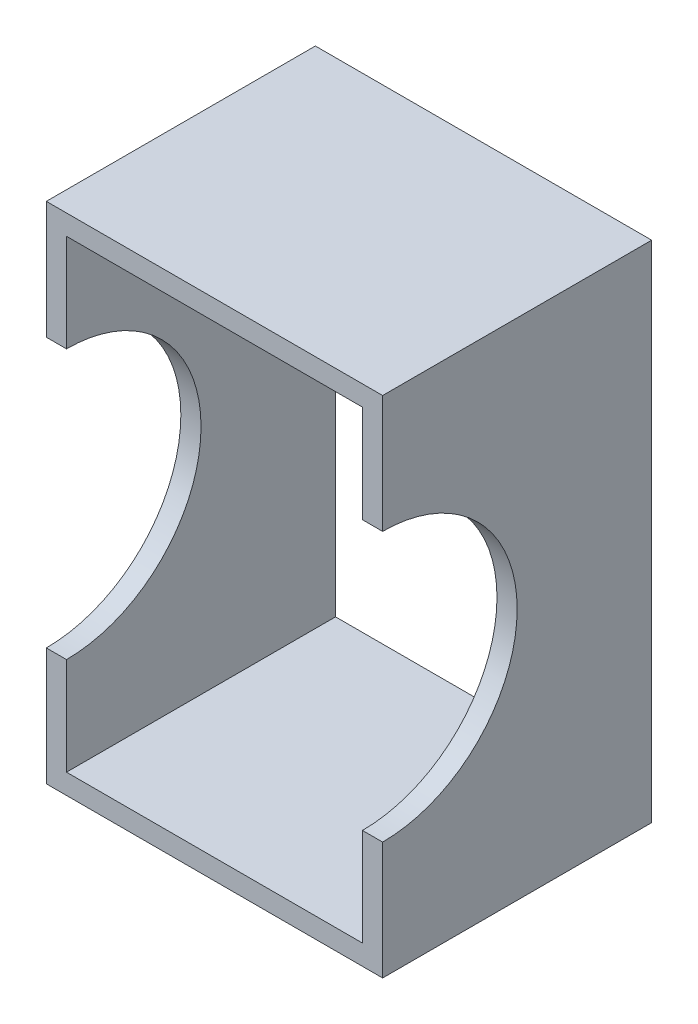
ISO-10303-21;
HEADER;
FILE_DESCRIPTION(('STEP AP214'),'2;1');
FILE_NAME('part.step','',(''),(''),'','','');
FILE_SCHEMA(('AUTOMOTIVE_DESIGN { 1 0 10303 214 1 1 1 1 }'));
ENDSEC;
DATA;
#1=APPLICATION_CONTEXT('core data for automotive mechanical design processes');
#2=APPLICATION_PROTOCOL_DEFINITION('international standard','automotive_design',2000,#1);
#3=PRODUCT_CONTEXT('',#1,'mechanical');
#4=PRODUCT('Part','Part','',(#3));
#5=PRODUCT_RELATED_PRODUCT_CATEGORY('part','',(#4));
#6=PRODUCT_DEFINITION_FORMATION('','',#4);
#7=PRODUCT_DEFINITION_CONTEXT('part definition',#1,'design');
#8=PRODUCT_DEFINITION('design','',#6,#7);
#9=PRODUCT_DEFINITION_SHAPE('','',#8);
#10=(LENGTH_UNIT() NAMED_UNIT(*) SI_UNIT(.MILLI.,.METRE.));
#11=(NAMED_UNIT(*) PLANE_ANGLE_UNIT() SI_UNIT($,.RADIAN.));
#12=(NAMED_UNIT(*) SI_UNIT($,.STERADIAN.) SOLID_ANGLE_UNIT());
#13=UNCERTAINTY_MEASURE_WITH_UNIT(LENGTH_MEASURE(1.E-05),#10,'distance_accuracy_value','');
#14=(GEOMETRIC_REPRESENTATION_CONTEXT(3) GLOBAL_UNCERTAINTY_ASSIGNED_CONTEXT((#13)) GLOBAL_UNIT_ASSIGNED_CONTEXT((#10,
#11,#12)) REPRESENTATION_CONTEXT('',''));
#15=CARTESIAN_POINT('',(0.,0.,0.));
#16=DIRECTION('',(0.,0.,1.));
#17=DIRECTION('',(1.,0.,0.));
#18=AXIS2_PLACEMENT_3D('',#15,#16,#17);
#19=CARTESIAN_POINT('',(0.,0.,0.));
#20=DIRECTION('',(0.,0.,-1.));
#21=DIRECTION('',(-1.,0.,0.));
#22=AXIS2_PLACEMENT_3D('',#19,#20,#21);
#23=PLANE('',#22);
#24=DIRECTION('',(0.,-1.,0.));
#25=VECTOR('',#24,1.);
#26=CARTESIAN_POINT('',(-50.,-75.,0.));
#27=LINE('',#26,#25);
#28=CARTESIAN_POINT('',(-50.,74.9999999999999,0.));
#29=VERTEX_POINT('',#28);
#30=CARTESIAN_POINT('',(-50.,40.,0.));
#31=VERTEX_POINT('',#30);
#32=EDGE_CURVE('E136',#29,#31,#27,.T.);
#33=ORIENTED_EDGE('',*,*,#32,.T.);
#34=DIRECTION('',(1.,0.,0.));
#35=VECTOR('',#34,1.);
#36=CARTESIAN_POINT('',(-50.,40.,0.));
#37=LINE('',#36,#35);
#38=CARTESIAN_POINT('',(-44.,40.,0.));
#39=VERTEX_POINT('',#38);
#40=EDGE_CURVE('E123',#31,#39,#37,.T.);
#41=ORIENTED_EDGE('',*,*,#40,.T.);
#42=DIRECTION('',(0.,-1.,0.));
#43=VECTOR('',#42,1.);
#44=CARTESIAN_POINT('',(-44.,-69.,0.));
#45=LINE('',#44,#43);
#46=CARTESIAN_POINT('',(-44.,69.,0.));
#47=VERTEX_POINT('',#46);
#48=EDGE_CURVE('E204',#47,#39,#45,.T.);
#49=ORIENTED_EDGE('',*,*,#48,.F.);
#50=DIRECTION('',(-1.,0.,0.));
#51=VECTOR('',#50,1.);
#52=CARTESIAN_POINT('',(-44.,69.,0.));
#53=LINE('',#52,#51);
#54=CARTESIAN_POINT('',(44.,69.,0.));
#55=VERTEX_POINT('',#54);
#56=EDGE_CURVE('E194',#55,#47,#53,.T.);
#57=ORIENTED_EDGE('',*,*,#56,.F.);
#58=DIRECTION('',(0.,1.,0.));
#59=VECTOR('',#58,1.);
#60=CARTESIAN_POINT('',(44.,-69.,0.));
#61=LINE('',#60,#59);
#62=CARTESIAN_POINT('',(44.,40.,0.));
#63=VERTEX_POINT('',#62);
#64=EDGE_CURVE('E199',#63,#55,#61,.T.);
#65=ORIENTED_EDGE('',*,*,#64,.F.);
#66=CARTESIAN_POINT('',(50.,40.,0.));
#67=VERTEX_POINT('',#66);
#68=EDGE_CURVE('E61',#63,#67,#37,.T.);
#69=ORIENTED_EDGE('',*,*,#68,.T.);
#70=DIRECTION('',(0.,1.,0.));
#71=VECTOR('',#70,1.);
#72=CARTESIAN_POINT('',(50.,-75.,0.));
#73=LINE('',#72,#71);
#74=CARTESIAN_POINT('',(50.,75.,0.));
#75=VERTEX_POINT('',#74);
#76=EDGE_CURVE('E151',#67,#75,#73,.T.);
#77=ORIENTED_EDGE('',*,*,#76,.T.);
#78=DIRECTION('',(-1.,0.,0.));
#79=VECTOR('',#78,1.);
#80=CARTESIAN_POINT('',(-50.,74.9999999999999,0.));
#81=LINE('',#80,#79);
#82=EDGE_CURVE('E150',#75,#29,#81,.T.);
#83=ORIENTED_EDGE('',*,*,#82,.T.);
#84=EDGE_LOOP('',(#33,#41,#49,#57,#65,#69,#77,#83));
#85=FACE_BOUND('',#84,.T.);
#86=ADVANCED_FACE('F39',(#85),#23,.F.);
#87=CARTESIAN_POINT('',(-50.,-75.,-80.));
#88=DIRECTION('',(-1.,0.,0.));
#89=DIRECTION('',(0.,-1.,0.));
#90=AXIS2_PLACEMENT_3D('',#87,#88,#89);
#91=PLANE('',#90);
#92=CARTESIAN_POINT('',(-50.,0.,0.));
#93=DIRECTION('',(1.,0.,0.));
#94=DIRECTION('',(0.,0.,-1.));
#95=AXIS2_PLACEMENT_3D('',#92,#93,#94);
#96=CIRCLE('',#95,40.);
#97=CARTESIAN_POINT('',(-50.,-40.,0.));
#98=VERTEX_POINT('',#97);
#99=EDGE_CURVE('E126',#98,#31,#96,.T.);
#100=ORIENTED_EDGE('',*,*,#99,.T.);
#101=ORIENTED_EDGE('',*,*,#32,.F.);
#102=DIRECTION('',(0.,0.,1.));
#103=VECTOR('',#102,1.);
#104=CARTESIAN_POINT('',(-50.,74.9999999999999,-80.));
#105=LINE('',#104,#103);
#106=CARTESIAN_POINT('',(-50.,74.9999999999999,-80.));
#107=VERTEX_POINT('',#106);
#108=EDGE_CURVE('E50',#107,#29,#105,.T.);
#109=ORIENTED_EDGE('',*,*,#108,.F.);
#110=DIRECTION('',(0.,-1.,0.));
#111=VECTOR('',#110,1.);
#112=CARTESIAN_POINT('',(-50.,-75.,-80.));
#113=LINE('',#112,#111);
#114=CARTESIAN_POINT('',(-50.,-75.,-80.));
#115=VERTEX_POINT('',#114);
#116=EDGE_CURVE('E165',#107,#115,#113,.T.);
#117=ORIENTED_EDGE('',*,*,#116,.T.);
#118=DIRECTION('',(0.,0.,1.));
#119=VECTOR('',#118,1.);
#120=CARTESIAN_POINT('',(-50.,-75.,-80.));
#121=LINE('',#120,#119);
#122=CARTESIAN_POINT('',(-50.,-75.,0.));
#123=VERTEX_POINT('',#122);
#124=EDGE_CURVE('E169',#115,#123,#121,.T.);
#125=ORIENTED_EDGE('',*,*,#124,.T.);
#126=EDGE_CURVE('E142',#98,#123,#27,.T.);
#127=ORIENTED_EDGE('',*,*,#126,.F.);
#128=EDGE_LOOP('',(#100,#101,#109,#117,#125,#127));
#129=FACE_BOUND('',#128,.T.);
#130=ADVANCED_FACE('F41',(#129),#91,.T.);
#131=CARTESIAN_POINT('',(-50.,74.9999999999999,-80.));
#132=DIRECTION('',(0.,1.,0.));
#133=DIRECTION('',(-1.,0.,0.));
#134=AXIS2_PLACEMENT_3D('',#131,#132,#133);
#135=PLANE('',#134);
#136=ORIENTED_EDGE('',*,*,#82,.F.);
#137=DIRECTION('',(0.,0.,1.));
#138=VECTOR('',#137,1.);
#139=CARTESIAN_POINT('',(50.,75.,-80.));
#140=LINE('',#139,#138);
#141=CARTESIAN_POINT('',(50.,75.,-80.));
#142=VERTEX_POINT('',#141);
#143=EDGE_CURVE('E163',#142,#75,#140,.T.);
#144=ORIENTED_EDGE('',*,*,#143,.F.);
#145=DIRECTION('',(-1.,0.,0.));
#146=VECTOR('',#145,1.);
#147=CARTESIAN_POINT('',(-50.,74.9999999999999,-80.));
#148=LINE('',#147,#146);
#149=EDGE_CURVE('E154',#142,#107,#148,.T.);
#150=ORIENTED_EDGE('',*,*,#149,.T.);
#151=ORIENTED_EDGE('',*,*,#108,.T.);
#152=EDGE_LOOP('',(#136,#144,#150,#151));
#153=FACE_BOUND('',#152,.T.);
#154=ADVANCED_FACE('F229',(#153),#135,.T.);
#155=CARTESIAN_POINT('',(50.,-75.,-80.));
#156=DIRECTION('',(1.,0.,0.));
#157=DIRECTION('',(0.,1.,0.));
#158=AXIS2_PLACEMENT_3D('',#155,#156,#157);
#159=PLANE('',#158);
#160=CARTESIAN_POINT('',(50.,0.,0.));
#161=DIRECTION('',(1.,0.,0.));
#162=DIRECTION('',(0.,0.,-1.));
#163=AXIS2_PLACEMENT_3D('',#160,#161,#162);
#164=CIRCLE('',#163,40.);
#165=CARTESIAN_POINT('',(50.,-40.,0.));
#166=VERTEX_POINT('',#165);
#167=EDGE_CURVE('E145',#166,#67,#164,.T.);
#168=ORIENTED_EDGE('',*,*,#167,.F.);
#169=CARTESIAN_POINT('',(50.,-75.,0.));
#170=VERTEX_POINT('',#169);
#171=EDGE_CURVE('E158',#170,#166,#73,.T.);
#172=ORIENTED_EDGE('',*,*,#171,.F.);
#173=DIRECTION('',(0.,0.,1.));
#174=VECTOR('',#173,1.);
#175=CARTESIAN_POINT('',(50.,-75.,-80.));
#176=LINE('',#175,#174);
#177=CARTESIAN_POINT('',(50.,-75.,-80.));
#178=VERTEX_POINT('',#177);
#179=EDGE_CURVE('E170',#178,#170,#176,.T.);
#180=ORIENTED_EDGE('',*,*,#179,.F.);
#181=DIRECTION('',(0.,1.,0.));
#182=VECTOR('',#181,1.);
#183=CARTESIAN_POINT('',(50.,-75.,-80.));
#184=LINE('',#183,#182);
#185=EDGE_CURVE('E171',#178,#142,#184,.T.);
#186=ORIENTED_EDGE('',*,*,#185,.T.);
#187=ORIENTED_EDGE('',*,*,#143,.T.);
#188=ORIENTED_EDGE('',*,*,#76,.F.);
#189=EDGE_LOOP('',(#168,#172,#180,#186,#187,#188));
#190=FACE_BOUND('',#189,.T.);
#191=ADVANCED_FACE('F223',(#190),#159,.T.);
#192=CARTESIAN_POINT('',(-50.,-75.,-80.));
#193=DIRECTION('',(0.,-1.,0.));
#194=DIRECTION('',(0.,0.,-1.));
#195=AXIS2_PLACEMENT_3D('',#192,#193,#194);
#196=PLANE('',#195);
#197=DIRECTION('',(1.,0.,0.));
#198=VECTOR('',#197,1.);
#199=CARTESIAN_POINT('',(-50.,-75.,0.));
#200=LINE('',#199,#198);
#201=EDGE_CURVE('E146',#123,#170,#200,.T.);
#202=ORIENTED_EDGE('',*,*,#201,.F.);
#203=ORIENTED_EDGE('',*,*,#124,.F.);
#204=DIRECTION('',(1.,0.,0.));
#205=VECTOR('',#204,1.);
#206=CARTESIAN_POINT('',(-50.,-75.,-80.));
#207=LINE('',#206,#205);
#208=EDGE_CURVE('E177',#115,#178,#207,.T.);
#209=ORIENTED_EDGE('',*,*,#208,.T.);
#210=ORIENTED_EDGE('',*,*,#179,.T.);
#211=EDGE_LOOP('',(#202,#203,#209,#210));
#212=FACE_BOUND('',#211,.T.);
#213=ADVANCED_FACE('F235',(#212),#196,.T.);
#214=CARTESIAN_POINT('',(0.,0.,-80.));
#215=DIRECTION('',(0.,0.,-1.));
#216=DIRECTION('',(-1.,0.,0.));
#217=AXIS2_PLACEMENT_3D('',#214,#215,#216);
#218=PLANE('',#217);
#219=DIRECTION('',(0.,-1.,0.));
#220=VECTOR('',#219,1.);
#221=CARTESIAN_POINT('',(-44.,-69.,-80.));
#222=LINE('',#221,#220);
#223=CARTESIAN_POINT('',(-44.,69.,-80.));
#224=VERTEX_POINT('',#223);
#225=CARTESIAN_POINT('',(-44.,-69.,-80.));
#226=VERTEX_POINT('',#225);
#227=EDGE_CURVE('E198',#224,#226,#222,.T.);
#228=ORIENTED_EDGE('',*,*,#227,.T.);
#229=DIRECTION('',(1.,0.,0.));
#230=VECTOR('',#229,1.);
#231=CARTESIAN_POINT('',(-44.,-69.,-80.));
#232=LINE('',#231,#230);
#233=CARTESIAN_POINT('',(44.,-69.,-80.));
#234=VERTEX_POINT('',#233);
#235=EDGE_CURVE('E211',#226,#234,#232,.T.);
#236=ORIENTED_EDGE('',*,*,#235,.T.);
#237=DIRECTION('',(0.,1.,0.));
#238=VECTOR('',#237,1.);
#239=CARTESIAN_POINT('',(44.,-69.,-80.));
#240=LINE('',#239,#238);
#241=CARTESIAN_POINT('',(44.,69.,-80.));
#242=VERTEX_POINT('',#241);
#243=EDGE_CURVE('E208',#234,#242,#240,.T.);
#244=ORIENTED_EDGE('',*,*,#243,.T.);
#245=DIRECTION('',(-1.,0.,0.));
#246=VECTOR('',#245,1.);
#247=CARTESIAN_POINT('',(-44.,69.,-80.));
#248=LINE('',#247,#246);
#249=EDGE_CURVE('E186',#242,#224,#248,.T.);
#250=ORIENTED_EDGE('',*,*,#249,.T.);
#251=EDGE_LOOP('',(#228,#236,#244,#250));
#252=FACE_BOUND('',#251,.T.);
#253=ORIENTED_EDGE('',*,*,#116,.F.);
#254=ORIENTED_EDGE('',*,*,#149,.F.);
#255=ORIENTED_EDGE('',*,*,#185,.F.);
#256=ORIENTED_EDGE('',*,*,#208,.F.);
#257=EDGE_LOOP('',(#253,#254,#255,#256));
#258=FACE_BOUND('',#257,.T.);
#259=ADVANCED_FACE('F227',(#252,#258),#218,.T.);
#260=ORIENTED_EDGE('',*,*,#171,.T.);
#261=DIRECTION('',(1.,0.,0.));
#262=VECTOR('',#261,1.);
#263=CARTESIAN_POINT('',(-50.,-40.,0.));
#264=LINE('',#263,#262);
#265=CARTESIAN_POINT('',(44.,-40.,0.));
#266=VERTEX_POINT('',#265);
#267=EDGE_CURVE('E141',#166,#266,#264,.F.);
#268=ORIENTED_EDGE('',*,*,#267,.T.);
#269=CARTESIAN_POINT('',(44.,-69.,0.));
#270=VERTEX_POINT('',#269);
#271=EDGE_CURVE('E197',#270,#266,#61,.T.);
#272=ORIENTED_EDGE('',*,*,#271,.F.);
#273=DIRECTION('',(1.,0.,0.));
#274=VECTOR('',#273,1.);
#275=CARTESIAN_POINT('',(-44.,-69.,0.));
#276=LINE('',#275,#274);
#277=CARTESIAN_POINT('',(-44.,-69.,0.));
#278=VERTEX_POINT('',#277);
#279=EDGE_CURVE('E203',#278,#270,#276,.T.);
#280=ORIENTED_EDGE('',*,*,#279,.F.);
#281=CARTESIAN_POINT('',(-44.,-40.,0.));
#282=VERTEX_POINT('',#281);
#283=EDGE_CURVE('E133',#282,#278,#45,.T.);
#284=ORIENTED_EDGE('',*,*,#283,.F.);
#285=EDGE_CURVE('E53',#282,#98,#264,.F.);
#286=ORIENTED_EDGE('',*,*,#285,.T.);
#287=ORIENTED_EDGE('',*,*,#126,.T.);
#288=ORIENTED_EDGE('',*,*,#201,.T.);
#289=EDGE_LOOP('',(#260,#268,#272,#280,#284,#286,#287,#288));
#290=FACE_BOUND('',#289,.T.);
#291=ADVANCED_FACE('F231',(#290),#23,.F.);
#292=CARTESIAN_POINT('',(-44.,-69.,-80.));
#293=DIRECTION('',(-1.,0.,0.));
#294=DIRECTION('',(0.,0.,1.));
#295=AXIS2_PLACEMENT_3D('',#292,#293,#294);
#296=PLANE('',#295);
#297=ORIENTED_EDGE('',*,*,#48,.T.);
#298=CARTESIAN_POINT('',(-44.,0.,0.));
#299=DIRECTION('',(-1.,0.,0.));
#300=DIRECTION('',(0.,0.,1.));
#301=AXIS2_PLACEMENT_3D('',#298,#299,#300);
#302=CIRCLE('',#301,40.);
#303=EDGE_CURVE('E129',#39,#282,#302,.T.);
#304=ORIENTED_EDGE('',*,*,#303,.T.);
#305=ORIENTED_EDGE('',*,*,#283,.T.);
#306=DIRECTION('',(0.,0.,1.));
#307=VECTOR('',#306,1.);
#308=CARTESIAN_POINT('',(-44.,-69.,-80.));
#309=LINE('',#308,#307);
#310=EDGE_CURVE('E181',#226,#278,#309,.T.);
#311=ORIENTED_EDGE('',*,*,#310,.F.);
#312=ORIENTED_EDGE('',*,*,#227,.F.);
#313=DIRECTION('',(0.,0.,1.));
#314=VECTOR('',#313,1.);
#315=CARTESIAN_POINT('',(-44.,69.,-80.));
#316=LINE('',#315,#314);
#317=EDGE_CURVE('E153',#224,#47,#316,.T.);
#318=ORIENTED_EDGE('',*,*,#317,.T.);
#319=EDGE_LOOP('',(#297,#304,#305,#311,#312,#318));
#320=FACE_BOUND('',#319,.T.);
#321=ADVANCED_FACE('F239',(#320),#296,.F.);
#322=CARTESIAN_POINT('',(-44.,69.,-80.));
#323=DIRECTION('',(0.,1.,0.));
#324=DIRECTION('',(0.,0.,1.));
#325=AXIS2_PLACEMENT_3D('',#322,#323,#324);
#326=PLANE('',#325);
#327=ORIENTED_EDGE('',*,*,#56,.T.);
#328=ORIENTED_EDGE('',*,*,#317,.F.);
#329=ORIENTED_EDGE('',*,*,#249,.F.);
#330=DIRECTION('',(0.,0.,1.));
#331=VECTOR('',#330,1.);
#332=CARTESIAN_POINT('',(44.,69.,-80.));
#333=LINE('',#332,#331);
#334=EDGE_CURVE('E188',#242,#55,#333,.T.);
#335=ORIENTED_EDGE('',*,*,#334,.T.);
#336=EDGE_LOOP('',(#327,#328,#329,#335));
#337=FACE_BOUND('',#336,.T.);
#338=ADVANCED_FACE('F249',(#337),#326,.F.);
#339=CARTESIAN_POINT('',(44.,-69.,-80.));
#340=DIRECTION('',(1.,0.,0.));
#341=DIRECTION('',(0.,0.,-1.));
#342=AXIS2_PLACEMENT_3D('',#339,#340,#341);
#343=PLANE('',#342);
#344=ORIENTED_EDGE('',*,*,#271,.T.);
#345=CARTESIAN_POINT('',(44.,0.,0.));
#346=DIRECTION('',(1.,0.,0.));
#347=DIRECTION('',(0.,0.,-1.));
#348=AXIS2_PLACEMENT_3D('',#345,#346,#347);
#349=CIRCLE('',#348,40.);
#350=EDGE_CURVE('E11',#266,#63,#349,.T.);
#351=ORIENTED_EDGE('',*,*,#350,.T.);
#352=ORIENTED_EDGE('',*,*,#64,.T.);
#353=ORIENTED_EDGE('',*,*,#334,.F.);
#354=ORIENTED_EDGE('',*,*,#243,.F.);
#355=DIRECTION('',(0.,0.,1.));
#356=VECTOR('',#355,1.);
#357=CARTESIAN_POINT('',(44.,-69.,-80.));
#358=LINE('',#357,#356);
#359=EDGE_CURVE('E189',#234,#270,#358,.T.);
#360=ORIENTED_EDGE('',*,*,#359,.T.);
#361=EDGE_LOOP('',(#344,#351,#352,#353,#354,#360));
#362=FACE_BOUND('',#361,.T.);
#363=ADVANCED_FACE('F248',(#362),#343,.F.);
#364=CARTESIAN_POINT('',(-44.,-69.,-80.));
#365=DIRECTION('',(0.,-1.,0.));
#366=DIRECTION('',(0.,0.,-1.));
#367=AXIS2_PLACEMENT_3D('',#364,#365,#366);
#368=PLANE('',#367);
#369=ORIENTED_EDGE('',*,*,#279,.T.);
#370=ORIENTED_EDGE('',*,*,#359,.F.);
#371=ORIENTED_EDGE('',*,*,#235,.F.);
#372=ORIENTED_EDGE('',*,*,#310,.T.);
#373=EDGE_LOOP('',(#369,#370,#371,#372));
#374=FACE_BOUND('',#373,.T.);
#375=ADVANCED_FACE('F245',(#374),#368,.F.);
#376=CARTESIAN_POINT('',(-50.,0.,0.));
#377=DIRECTION('',(1.,0.,0.));
#378=DIRECTION('',(0.,0.,-1.));
#379=AXIS2_PLACEMENT_3D('',#376,#377,#378);
#380=CYLINDRICAL_SURFACE('',#379,40.);
#381=ORIENTED_EDGE('',*,*,#350,.F.);
#382=ORIENTED_EDGE('',*,*,#267,.F.);
#383=ORIENTED_EDGE('',*,*,#167,.T.);
#384=ORIENTED_EDGE('',*,*,#68,.F.);
#385=EDGE_LOOP('',(#381,#382,#383,#384));
#386=FACE_BOUND('',#385,.T.);
#387=ADVANCED_FACE('F219',(#386),#380,.F.);
#388=ORIENTED_EDGE('',*,*,#99,.F.);
#389=ORIENTED_EDGE('',*,*,#285,.F.);
#390=ORIENTED_EDGE('',*,*,#303,.F.);
#391=ORIENTED_EDGE('',*,*,#40,.F.);
#392=EDGE_LOOP('',(#388,#389,#390,#391));
#393=FACE_BOUND('',#392,.T.);
#394=ADVANCED_FACE('F130',(#393),#380,.F.);
#395=CLOSED_SHELL('',(#86,#130,#154,#191,#213,#259,#291,#321,#338,#363,#375,#387,#394));
#396=MANIFOLD_SOLID_BREP('B2',#395);
#397=ADVANCED_BREP_SHAPE_REPRESENTATION('',(#18,#396),#14);
#398=SHAPE_DEFINITION_REPRESENTATION(#9,#397);
ENDSEC;
END-ISO-10303-21;
